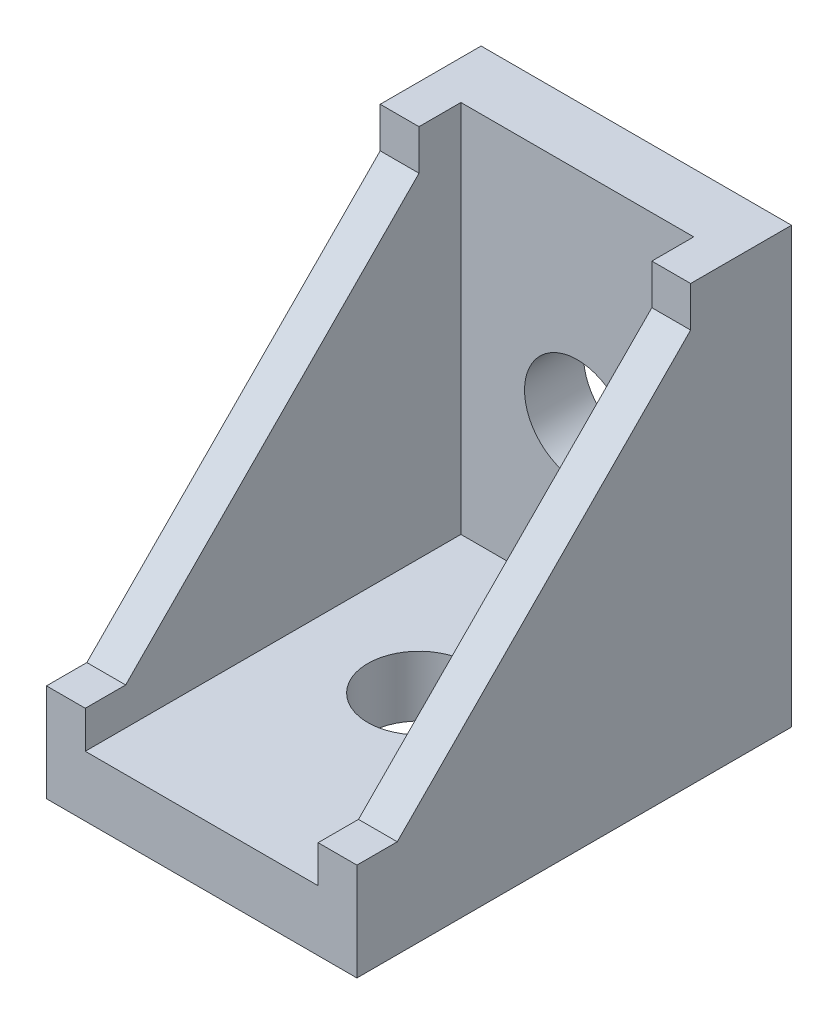
ISO-10303-21;
HEADER;
FILE_DESCRIPTION(('STEP AP214'),'2;1');
FILE_NAME('part.step','',(''),(''),'','','');
FILE_SCHEMA(('AUTOMOTIVE_DESIGN { 1 0 10303 214 1 1 1 1 }'));
ENDSEC;
DATA;
#1=APPLICATION_CONTEXT('core data for automotive mechanical design processes');
#2=APPLICATION_PROTOCOL_DEFINITION('international standard','automotive_design',2000,#1);
#3=PRODUCT_CONTEXT('',#1,'mechanical');
#4=PRODUCT('Part','Part','',(#3));
#5=PRODUCT_RELATED_PRODUCT_CATEGORY('part','',(#4));
#6=PRODUCT_DEFINITION_FORMATION('','',#4);
#7=PRODUCT_DEFINITION_CONTEXT('part definition',#1,'design');
#8=PRODUCT_DEFINITION('design','',#6,#7);
#9=PRODUCT_DEFINITION_SHAPE('','',#8);
#10=(LENGTH_UNIT() NAMED_UNIT(*) SI_UNIT(.MILLI.,.METRE.));
#11=(NAMED_UNIT(*) PLANE_ANGLE_UNIT() SI_UNIT($,.RADIAN.));
#12=(NAMED_UNIT(*) SI_UNIT($,.STERADIAN.) SOLID_ANGLE_UNIT());
#13=UNCERTAINTY_MEASURE_WITH_UNIT(LENGTH_MEASURE(1.E-05),#10,'distance_accuracy_value','');
#14=(GEOMETRIC_REPRESENTATION_CONTEXT(3) GLOBAL_UNCERTAINTY_ASSIGNED_CONTEXT((#13)) GLOBAL_UNIT_ASSIGNED_CONTEXT((#10,
#11,#12)) REPRESENTATION_CONTEXT('',''));
#15=CARTESIAN_POINT('',(0.,0.,0.));
#16=DIRECTION('',(0.,0.,1.));
#17=DIRECTION('',(1.,0.,0.));
#18=AXIS2_PLACEMENT_3D('',#15,#16,#17);
#19=CARTESIAN_POINT('',(7.5,14.,6.5));
#20=DIRECTION('',(0.,0.,-1.));
#21=DIRECTION('',(0.,1.,0.));
#22=AXIS2_PLACEMENT_3D('',#19,#20,#21);
#23=PLANE('',#22);
#24=DIRECTION('',(1.,0.,0.));
#25=VECTOR('',#24,1.);
#26=CARTESIAN_POINT('',(7.5,11.4,6.5));
#27=LINE('',#26,#25);
#28=CARTESIAN_POINT('',(7.5,11.4,6.5));
#29=VERTEX_POINT('',#28);
#30=CARTESIAN_POINT('',(10.,11.4,6.5));
#31=VERTEX_POINT('',#30);
#32=EDGE_CURVE('E53',#29,#31,#27,.T.);
#33=ORIENTED_EDGE('',*,*,#32,.T.);
#34=DIRECTION('',(0.,1.,0.));
#35=VECTOR('',#34,1.);
#36=CARTESIAN_POINT('',(10.,14.,6.5));
#37=LINE('',#36,#35);
#38=CARTESIAN_POINT('',(10.,14.,6.5));
#39=VERTEX_POINT('',#38);
#40=EDGE_CURVE('E164',#31,#39,#37,.T.);
#41=ORIENTED_EDGE('',*,*,#40,.T.);
#42=DIRECTION('',(1.,0.,0.));
#43=VECTOR('',#42,1.);
#44=CARTESIAN_POINT('',(7.5,14.,6.5));
#45=LINE('',#44,#43);
#46=CARTESIAN_POINT('',(7.5,14.,6.5));
#47=VERTEX_POINT('',#46);
#48=EDGE_CURVE('E176',#47,#39,#45,.T.);
#49=ORIENTED_EDGE('',*,*,#48,.F.);
#50=DIRECTION('',(0.,1.,0.));
#51=VECTOR('',#50,1.);
#52=CARTESIAN_POINT('',(7.5,14.,6.5));
#53=LINE('',#52,#51);
#54=EDGE_CURVE('E58',#29,#47,#53,.T.);
#55=ORIENTED_EDGE('',*,*,#54,.F.);
#56=EDGE_LOOP('',(#33,#41,#49,#55));
#57=FACE_BOUND('',#56,.T.);
#58=ADVANCED_FACE('F38',(#57),#23,.F.);
#59=CARTESIAN_POINT('',(7.5,-7.69999999999999,28.));
#60=DIRECTION('',(0.,-1.,0.));
#61=DIRECTION('',(0.,0.,-1.));
#62=AXIS2_PLACEMENT_3D('',#59,#60,#61);
#63=PLANE('',#62);
#64=DIRECTION('',(1.,0.,0.));
#65=VECTOR('',#64,1.);
#66=CARTESIAN_POINT('',(7.5,-7.69999999999999,25.4));
#67=LINE('',#66,#65);
#68=CARTESIAN_POINT('',(7.5,-7.69999999999999,25.4));
#69=VERTEX_POINT('',#68);
#70=CARTESIAN_POINT('',(10.,-7.69999999999999,25.4));
#71=VERTEX_POINT('',#70);
#72=EDGE_CURVE('E288',#69,#71,#67,.T.);
#73=ORIENTED_EDGE('',*,*,#72,.F.);
#74=DIRECTION('',(0.,0.,-1.));
#75=VECTOR('',#74,1.);
#76=CARTESIAN_POINT('',(7.5,-7.69999999999999,28.));
#77=LINE('',#76,#75);
#78=CARTESIAN_POINT('',(7.5,-7.69999999999999,28.));
#79=VERTEX_POINT('',#78);
#80=EDGE_CURVE('E265',#79,#69,#77,.T.);
#81=ORIENTED_EDGE('',*,*,#80,.F.);
#82=DIRECTION('',(1.,0.,0.));
#83=VECTOR('',#82,1.);
#84=CARTESIAN_POINT('',(7.5,-7.69999999999999,28.));
#85=LINE('',#84,#83);
#86=CARTESIAN_POINT('',(10.,-7.69999999999999,28.));
#87=VERTEX_POINT('',#86);
#88=EDGE_CURVE('E170',#79,#87,#85,.T.);
#89=ORIENTED_EDGE('',*,*,#88,.T.);
#90=DIRECTION('',(0.,0.,-1.));
#91=VECTOR('',#90,1.);
#92=CARTESIAN_POINT('',(10.,-7.69999999999999,28.));
#93=LINE('',#92,#91);
#94=EDGE_CURVE('E258',#87,#71,#93,.T.);
#95=ORIENTED_EDGE('',*,*,#94,.T.);
#96=EDGE_LOOP('',(#73,#81,#89,#95));
#97=FACE_BOUND('',#96,.T.);
#98=ADVANCED_FACE('F271',(#97),#63,.F.);
#99=CARTESIAN_POINT('',(0.,-10.1,0.));
#100=DIRECTION('',(0.,-1.,0.));
#101=DIRECTION('',(0.,0.,-1.));
#102=AXIS2_PLACEMENT_3D('',#99,#100,#101);
#103=PLANE('',#102);
#104=CARTESIAN_POINT('',(0.,-10.1,14.));
#105=DIRECTION('',(0.,-1.,0.));
#106=DIRECTION('',(0.,0.,-1.));
#107=AXIS2_PLACEMENT_3D('',#104,#105,#106);
#108=CIRCLE('',#107,3.3);
#109=CARTESIAN_POINT('',(0.,-10.1,10.7));
#110=VERTEX_POINT('',#109);
#111=EDGE_CURVE('E194',#110,#110,#108,.T.);
#112=ORIENTED_EDGE('',*,*,#111,.T.);
#113=EDGE_LOOP('',(#112));
#114=FACE_BOUND('',#113,.T.);
#115=DIRECTION('',(-1.,0.,0.));
#116=VECTOR('',#115,1.);
#117=CARTESIAN_POINT('',(10.,-10.1,28.));
#118=LINE('',#117,#116);
#119=CARTESIAN_POINT('',(7.5,-10.1,28.));
#120=VERTEX_POINT('',#119);
#121=CARTESIAN_POINT('',(-7.5,-10.1,28.));
#122=VERTEX_POINT('',#121);
#123=EDGE_CURVE('E200',#120,#122,#118,.T.);
#124=ORIENTED_EDGE('',*,*,#123,.F.);
#125=DIRECTION('',(0.,0.,1.));
#126=VECTOR('',#125,1.);
#127=CARTESIAN_POINT('',(7.5,-10.1,0.));
#128=LINE('',#127,#126);
#129=CARTESIAN_POINT('',(7.5,-10.1,3.8));
#130=VERTEX_POINT('',#129);
#131=EDGE_CURVE('E11',#130,#120,#128,.T.);
#132=ORIENTED_EDGE('',*,*,#131,.F.);
#133=DIRECTION('',(1.,0.,0.));
#134=VECTOR('',#133,1.);
#135=CARTESIAN_POINT('',(0.,-10.1,3.8));
#136=LINE('',#135,#134);
#137=CARTESIAN_POINT('',(-7.5,-10.1,3.8));
#138=VERTEX_POINT('',#137);
#139=EDGE_CURVE('E207',#138,#130,#136,.T.);
#140=ORIENTED_EDGE('',*,*,#139,.F.);
#141=DIRECTION('',(0.,0.,-1.));
#142=VECTOR('',#141,1.);
#143=CARTESIAN_POINT('',(-7.5,-10.1,0.));
#144=LINE('',#143,#142);
#145=EDGE_CURVE('E46',#122,#138,#144,.T.);
#146=ORIENTED_EDGE('',*,*,#145,.F.);
#147=EDGE_LOOP('',(#124,#132,#140,#146));
#148=FACE_BOUND('',#147,.T.);
#149=ADVANCED_FACE('F246',(#114,#148),#103,.F.);
#150=CARTESIAN_POINT('',(0.,0.,3.8));
#151=DIRECTION('',(0.,0.,1.));
#152=DIRECTION('',(1.,0.,0.));
#153=AXIS2_PLACEMENT_3D('',#150,#151,#152);
#154=PLANE('',#153);
#155=CARTESIAN_POINT('',(0.,0.,3.8));
#156=DIRECTION('',(0.,0.,1.));
#157=DIRECTION('',(1.,0.,0.));
#158=AXIS2_PLACEMENT_3D('',#155,#156,#157);
#159=CIRCLE('',#158,3.4);
#160=CARTESIAN_POINT('',(3.4,0.,3.8));
#161=VERTEX_POINT('',#160);
#162=EDGE_CURVE('E213',#161,#161,#159,.T.);
#163=ORIENTED_EDGE('',*,*,#162,.F.);
#164=EDGE_LOOP('',(#163));
#165=FACE_BOUND('',#164,.T.);
#166=ORIENTED_EDGE('',*,*,#139,.T.);
#167=DIRECTION('',(0.,1.,0.));
#168=VECTOR('',#167,1.);
#169=CARTESIAN_POINT('',(7.5,0.,3.8));
#170=LINE('',#169,#168);
#171=CARTESIAN_POINT('',(7.5,14.,3.8));
#172=VERTEX_POINT('',#171);
#173=EDGE_CURVE('E180',#130,#172,#170,.T.);
#174=ORIENTED_EDGE('',*,*,#173,.T.);
#175=DIRECTION('',(-1.,0.,0.));
#176=VECTOR('',#175,1.);
#177=CARTESIAN_POINT('',(-10.,14.,3.8));
#178=LINE('',#177,#176);
#179=CARTESIAN_POINT('',(-7.5,14.,3.8));
#180=VERTEX_POINT('',#179);
#181=EDGE_CURVE('E219',#172,#180,#178,.T.);
#182=ORIENTED_EDGE('',*,*,#181,.T.);
#183=DIRECTION('',(0.,-1.,0.));
#184=VECTOR('',#183,1.);
#185=CARTESIAN_POINT('',(-7.5,0.,3.8));
#186=LINE('',#185,#184);
#187=EDGE_CURVE('E191',#180,#138,#186,.T.);
#188=ORIENTED_EDGE('',*,*,#187,.T.);
#189=EDGE_LOOP('',(#166,#174,#182,#188));
#190=FACE_BOUND('',#189,.T.);
#191=ADVANCED_FACE('F248',(#165,#190),#154,.T.);
#192=CARTESIAN_POINT('',(0.,0.,0.));
#193=DIRECTION('',(0.,0.,1.));
#194=DIRECTION('',(1.,0.,0.));
#195=AXIS2_PLACEMENT_3D('',#192,#193,#194);
#196=PLANE('',#195);
#197=DIRECTION('',(-1.,0.,0.));
#198=VECTOR('',#197,1.);
#199=CARTESIAN_POINT('',(-10.,14.,0.));
#200=LINE('',#199,#198);
#201=CARTESIAN_POINT('',(10.,14.,0.));
#202=VERTEX_POINT('',#201);
#203=CARTESIAN_POINT('',(-10.,14.,0.));
#204=VERTEX_POINT('',#203);
#205=EDGE_CURVE('E224',#202,#204,#200,.T.);
#206=ORIENTED_EDGE('',*,*,#205,.F.);
#207=DIRECTION('',(0.,1.,0.));
#208=VECTOR('',#207,1.);
#209=CARTESIAN_POINT('',(10.,14.,0.));
#210=LINE('',#209,#208);
#211=CARTESIAN_POINT('',(10.,-14.,0.));
#212=VERTEX_POINT('',#211);
#213=EDGE_CURVE('E216',#212,#202,#210,.T.);
#214=ORIENTED_EDGE('',*,*,#213,.F.);
#215=DIRECTION('',(1.,0.,0.));
#216=VECTOR('',#215,1.);
#217=CARTESIAN_POINT('',(-10.,-14.,0.));
#218=LINE('',#217,#216);
#219=CARTESIAN_POINT('',(-10.,-14.,0.));
#220=VERTEX_POINT('',#219);
#221=EDGE_CURVE('E222',#220,#212,#218,.T.);
#222=ORIENTED_EDGE('',*,*,#221,.F.);
#223=DIRECTION('',(0.,-1.,0.));
#224=VECTOR('',#223,1.);
#225=CARTESIAN_POINT('',(-10.,14.,0.));
#226=LINE('',#225,#224);
#227=EDGE_CURVE('E226',#204,#220,#226,.T.);
#228=ORIENTED_EDGE('',*,*,#227,.F.);
#229=EDGE_LOOP('',(#206,#214,#222,#228));
#230=FACE_BOUND('',#229,.T.);
#231=CARTESIAN_POINT('',(0.,0.,0.));
#232=DIRECTION('',(0.,0.,1.));
#233=DIRECTION('',(1.,0.,0.));
#234=AXIS2_PLACEMENT_3D('',#231,#232,#233);
#235=CIRCLE('',#234,3.4);
#236=CARTESIAN_POINT('',(3.4,0.,0.));
#237=VERTEX_POINT('',#236);
#238=EDGE_CURVE('E212',#237,#237,#235,.T.);
#239=ORIENTED_EDGE('',*,*,#238,.T.);
#240=EDGE_LOOP('',(#239));
#241=FACE_BOUND('',#240,.T.);
#242=ADVANCED_FACE('F302',(#230,#241),#196,.F.);
#243=CARTESIAN_POINT('',(10.,14.,3.8));
#244=DIRECTION('',(-1.,0.,0.));
#245=DIRECTION('',(0.,-1.,0.));
#246=AXIS2_PLACEMENT_3D('',#243,#244,#245);
#247=PLANE('',#246);
#248=ORIENTED_EDGE('',*,*,#40,.F.);
#249=DIRECTION('',(0.,0.710818550760268,-0.703375424574297));
#250=VECTOR('',#249,1.);
#251=CARTESIAN_POINT('',(10.,11.4,6.5));
#252=LINE('',#251,#250);
#253=EDGE_CURVE('E281',#71,#31,#252,.T.);
#254=ORIENTED_EDGE('',*,*,#253,.F.);
#255=ORIENTED_EDGE('',*,*,#94,.F.);
#256=DIRECTION('',(0.,-1.,0.));
#257=VECTOR('',#256,1.);
#258=CARTESIAN_POINT('',(10.,-10.1,28.));
#259=LINE('',#258,#257);
#260=CARTESIAN_POINT('',(10.,-14.,28.));
#261=VERTEX_POINT('',#260);
#262=EDGE_CURVE('E202',#87,#261,#259,.T.);
#263=ORIENTED_EDGE('',*,*,#262,.T.);
#264=DIRECTION('',(0.,0.,-1.));
#265=VECTOR('',#264,1.);
#266=CARTESIAN_POINT('',(10.,-14.,3.8));
#267=LINE('',#266,#265);
#268=EDGE_CURVE('E221',#261,#212,#267,.T.);
#269=ORIENTED_EDGE('',*,*,#268,.T.);
#270=ORIENTED_EDGE('',*,*,#213,.T.);
#271=DIRECTION('',(0.,0.,-1.));
#272=VECTOR('',#271,1.);
#273=CARTESIAN_POINT('',(10.,14.,3.8));
#274=LINE('',#273,#272);
#275=EDGE_CURVE('E237',#39,#202,#274,.T.);
#276=ORIENTED_EDGE('',*,*,#275,.F.);
#277=EDGE_LOOP('',(#248,#254,#255,#263,#269,#270,#276));
#278=FACE_BOUND('',#277,.T.);
#279=ADVANCED_FACE('F40',(#278),#247,.F.);
#280=CARTESIAN_POINT('',(-10.,14.,3.8));
#281=DIRECTION('',(0.,-1.,0.));
#282=DIRECTION('',(0.,0.,-1.));
#283=AXIS2_PLACEMENT_3D('',#280,#281,#282);
#284=PLANE('',#283);
#285=ORIENTED_EDGE('',*,*,#205,.T.);
#286=DIRECTION('',(0.,0.,-1.));
#287=VECTOR('',#286,1.);
#288=CARTESIAN_POINT('',(-10.,14.,3.8));
#289=LINE('',#288,#287);
#290=CARTESIAN_POINT('',(-10.,14.,6.5));
#291=VERTEX_POINT('',#290);
#292=EDGE_CURVE('E234',#291,#204,#289,.T.);
#293=ORIENTED_EDGE('',*,*,#292,.F.);
#294=DIRECTION('',(-1.,0.,0.));
#295=VECTOR('',#294,1.);
#296=CARTESIAN_POINT('',(-7.5,14.,6.5));
#297=LINE('',#296,#295);
#298=CARTESIAN_POINT('',(-7.5,14.,6.5));
#299=VERTEX_POINT('',#298);
#300=EDGE_CURVE('E187',#299,#291,#297,.T.);
#301=ORIENTED_EDGE('',*,*,#300,.F.);
#302=DIRECTION('',(0.,0.,-1.));
#303=VECTOR('',#302,1.);
#304=CARTESIAN_POINT('',(-7.5,14.,0.));
#305=LINE('',#304,#303);
#306=EDGE_CURVE('E184',#299,#180,#305,.T.);
#307=ORIENTED_EDGE('',*,*,#306,.T.);
#308=ORIENTED_EDGE('',*,*,#181,.F.);
#309=DIRECTION('',(0.,0.,-1.));
#310=VECTOR('',#309,1.);
#311=CARTESIAN_POINT('',(7.5,14.,0.));
#312=LINE('',#311,#310);
#313=EDGE_CURVE('E172',#47,#172,#312,.T.);
#314=ORIENTED_EDGE('',*,*,#313,.F.);
#315=ORIENTED_EDGE('',*,*,#48,.T.);
#316=ORIENTED_EDGE('',*,*,#275,.T.);
#317=EDGE_LOOP('',(#285,#293,#301,#307,#308,#314,#315,#316));
#318=FACE_BOUND('',#317,.T.);
#319=ADVANCED_FACE('F252',(#318),#284,.F.);
#320=CARTESIAN_POINT('',(-10.,14.,3.8));
#321=DIRECTION('',(1.,0.,0.));
#322=DIRECTION('',(0.,1.,0.));
#323=AXIS2_PLACEMENT_3D('',#320,#321,#322);
#324=PLANE('',#323);
#325=DIRECTION('',(0.,0.710818550760268,-0.703375424574297));
#326=VECTOR('',#325,1.);
#327=CARTESIAN_POINT('',(-10.,11.4,6.5));
#328=LINE('',#327,#326);
#329=CARTESIAN_POINT('',(-10.,-7.69999999999999,25.4));
#330=VERTEX_POINT('',#329);
#331=CARTESIAN_POINT('',(-10.,11.4,6.5));
#332=VERTEX_POINT('',#331);
#333=EDGE_CURVE('E142',#330,#332,#328,.T.);
#334=ORIENTED_EDGE('',*,*,#333,.T.);
#335=DIRECTION('',(0.,1.,0.));
#336=VECTOR('',#335,1.);
#337=CARTESIAN_POINT('',(-10.,14.,6.5));
#338=LINE('',#337,#336);
#339=EDGE_CURVE('E182',#332,#291,#338,.T.);
#340=ORIENTED_EDGE('',*,*,#339,.T.);
#341=ORIENTED_EDGE('',*,*,#292,.T.);
#342=ORIENTED_EDGE('',*,*,#227,.T.);
#343=DIRECTION('',(0.,0.,-1.));
#344=VECTOR('',#343,1.);
#345=CARTESIAN_POINT('',(-10.,-14.,3.8));
#346=LINE('',#345,#344);
#347=CARTESIAN_POINT('',(-10.,-14.,28.));
#348=VERTEX_POINT('',#347);
#349=EDGE_CURVE('E231',#348,#220,#346,.T.);
#350=ORIENTED_EDGE('',*,*,#349,.F.);
#351=DIRECTION('',(0.,-1.,0.));
#352=VECTOR('',#351,1.);
#353=CARTESIAN_POINT('',(-10.,-10.1,28.));
#354=LINE('',#353,#352);
#355=CARTESIAN_POINT('',(-10.,-7.69999999999999,28.));
#356=VERTEX_POINT('',#355);
#357=EDGE_CURVE('E204',#356,#348,#354,.T.);
#358=ORIENTED_EDGE('',*,*,#357,.F.);
#359=DIRECTION('',(0.,0.,-1.));
#360=VECTOR('',#359,1.);
#361=CARTESIAN_POINT('',(-10.,-7.69999999999999,28.));
#362=LINE('',#361,#360);
#363=EDGE_CURVE('E166',#356,#330,#362,.T.);
#364=ORIENTED_EDGE('',*,*,#363,.T.);
#365=EDGE_LOOP('',(#334,#340,#341,#342,#350,#358,#364));
#366=FACE_BOUND('',#365,.T.);
#367=ADVANCED_FACE('F292',(#366),#324,.F.);
#368=CARTESIAN_POINT('',(-10.,-14.,3.8));
#369=DIRECTION('',(0.,1.,0.));
#370=DIRECTION('',(0.,0.,1.));
#371=AXIS2_PLACEMENT_3D('',#368,#369,#370);
#372=PLANE('',#371);
#373=DIRECTION('',(-1.,0.,0.));
#374=VECTOR('',#373,1.);
#375=CARTESIAN_POINT('',(10.,-14.,28.));
#376=LINE('',#375,#374);
#377=EDGE_CURVE('E197',#261,#348,#376,.T.);
#378=ORIENTED_EDGE('',*,*,#377,.T.);
#379=ORIENTED_EDGE('',*,*,#349,.T.);
#380=ORIENTED_EDGE('',*,*,#221,.T.);
#381=ORIENTED_EDGE('',*,*,#268,.F.);
#382=EDGE_LOOP('',(#378,#379,#380,#381));
#383=FACE_BOUND('',#382,.T.);
#384=CARTESIAN_POINT('',(0.,-14.,14.));
#385=DIRECTION('',(0.,-1.,0.));
#386=DIRECTION('',(0.,0.,-1.));
#387=AXIS2_PLACEMENT_3D('',#384,#385,#386);
#388=CIRCLE('',#387,3.3);
#389=CARTESIAN_POINT('',(0.,-14.,10.7));
#390=VERTEX_POINT('',#389);
#391=EDGE_CURVE('E193',#390,#390,#388,.T.);
#392=ORIENTED_EDGE('',*,*,#391,.F.);
#393=EDGE_LOOP('',(#392));
#394=FACE_BOUND('',#393,.T.);
#395=ADVANCED_FACE('F297',(#383,#394),#372,.F.);
#396=CARTESIAN_POINT('',(0.,0.,3.8));
#397=DIRECTION('',(0.,0.,-1.));
#398=DIRECTION('',(-1.,0.,0.));
#399=AXIS2_PLACEMENT_3D('',#396,#397,#398);
#400=CYLINDRICAL_SURFACE('',#399,3.4);
#401=ORIENTED_EDGE('',*,*,#162,.T.);
#402=EDGE_LOOP('',(#401));
#403=FACE_BOUND('',#402,.T.);
#404=ORIENTED_EDGE('',*,*,#238,.F.);
#405=EDGE_LOOP('',(#404));
#406=FACE_BOUND('',#405,.T.);
#407=ADVANCED_FACE('F327',(#403,#406),#400,.F.);
#408=CARTESIAN_POINT('',(10.,-10.1,28.));
#409=DIRECTION('',(0.,0.,1.));
#410=DIRECTION('',(1.,0.,0.));
#411=AXIS2_PLACEMENT_3D('',#408,#409,#410);
#412=PLANE('',#411);
#413=ORIENTED_EDGE('',*,*,#262,.F.);
#414=ORIENTED_EDGE('',*,*,#88,.F.);
#415=DIRECTION('',(0.,1.,0.));
#416=VECTOR('',#415,1.);
#417=CARTESIAN_POINT('',(7.5,-14.,28.));
#418=LINE('',#417,#416);
#419=EDGE_CURVE('E260',#120,#79,#418,.T.);
#420=ORIENTED_EDGE('',*,*,#419,.F.);
#421=ORIENTED_EDGE('',*,*,#123,.T.);
#422=DIRECTION('',(0.,1.,0.));
#423=VECTOR('',#422,1.);
#424=CARTESIAN_POINT('',(-7.5,-14.,28.));
#425=LINE('',#424,#423);
#426=CARTESIAN_POINT('',(-7.5,-7.69999999999999,28.));
#427=VERTEX_POINT('',#426);
#428=EDGE_CURVE('E162',#122,#427,#425,.T.);
#429=ORIENTED_EDGE('',*,*,#428,.T.);
#430=DIRECTION('',(-1.,0.,0.));
#431=VECTOR('',#430,1.);
#432=CARTESIAN_POINT('',(-7.5,-7.69999999999999,28.));
#433=LINE('',#432,#431);
#434=EDGE_CURVE('E161',#427,#356,#433,.T.);
#435=ORIENTED_EDGE('',*,*,#434,.T.);
#436=ORIENTED_EDGE('',*,*,#357,.T.);
#437=ORIENTED_EDGE('',*,*,#377,.F.);
#438=EDGE_LOOP('',(#413,#414,#420,#421,#429,#435,#436,#437));
#439=FACE_BOUND('',#438,.T.);
#440=ADVANCED_FACE('F276',(#439),#412,.T.);
#441=CARTESIAN_POINT('',(0.,-10.1,14.));
#442=DIRECTION('',(0.,-1.,0.));
#443=DIRECTION('',(0.,0.,-1.));
#444=AXIS2_PLACEMENT_3D('',#441,#442,#443);
#445=CYLINDRICAL_SURFACE('',#444,3.3);
#446=ORIENTED_EDGE('',*,*,#111,.F.);
#447=EDGE_LOOP('',(#446));
#448=FACE_BOUND('',#447,.T.);
#449=ORIENTED_EDGE('',*,*,#391,.T.);
#450=EDGE_LOOP('',(#449));
#451=FACE_BOUND('',#450,.T.);
#452=ADVANCED_FACE('F318',(#448,#451),#445,.F.);
#453=CARTESIAN_POINT('',(-7.5,14.,6.5));
#454=DIRECTION('',(0.,0.,1.));
#455=DIRECTION('',(0.,-1.,0.));
#456=AXIS2_PLACEMENT_3D('',#453,#454,#455);
#457=PLANE('',#456);
#458=DIRECTION('',(-1.,0.,0.));
#459=VECTOR('',#458,1.);
#460=CARTESIAN_POINT('',(-7.5,11.4,6.5));
#461=LINE('',#460,#459);
#462=CARTESIAN_POINT('',(-7.5,11.4,6.5));
#463=VERTEX_POINT('',#462);
#464=EDGE_CURVE('E147',#463,#332,#461,.T.);
#465=ORIENTED_EDGE('',*,*,#464,.F.);
#466=DIRECTION('',(0.,1.,0.));
#467=VECTOR('',#466,1.);
#468=CARTESIAN_POINT('',(-7.5,14.,6.5));
#469=LINE('',#468,#467);
#470=EDGE_CURVE('E156',#463,#299,#469,.T.);
#471=ORIENTED_EDGE('',*,*,#470,.T.);
#472=ORIENTED_EDGE('',*,*,#300,.T.);
#473=ORIENTED_EDGE('',*,*,#339,.F.);
#474=EDGE_LOOP('',(#465,#471,#472,#473));
#475=FACE_BOUND('',#474,.T.);
#476=ADVANCED_FACE('F257',(#475),#457,.T.);
#477=CARTESIAN_POINT('',(-7.5,0.,0.));
#478=DIRECTION('',(-1.,0.,0.));
#479=DIRECTION('',(0.,-1.,0.));
#480=AXIS2_PLACEMENT_3D('',#477,#478,#479);
#481=PLANE('',#480);
#482=ORIENTED_EDGE('',*,*,#470,.F.);
#483=DIRECTION('',(0.,0.710818550760268,-0.703375424574297));
#484=VECTOR('',#483,1.);
#485=CARTESIAN_POINT('',(-7.5,11.4,6.5));
#486=LINE('',#485,#484);
#487=CARTESIAN_POINT('',(-7.5,-7.69999999999999,25.4));
#488=VERTEX_POINT('',#487);
#489=EDGE_CURVE('E139',#488,#463,#486,.T.);
#490=ORIENTED_EDGE('',*,*,#489,.F.);
#491=DIRECTION('',(0.,0.,-1.));
#492=VECTOR('',#491,1.);
#493=CARTESIAN_POINT('',(-7.5,-7.69999999999999,28.));
#494=LINE('',#493,#492);
#495=EDGE_CURVE('E154',#427,#488,#494,.T.);
#496=ORIENTED_EDGE('',*,*,#495,.F.);
#497=ORIENTED_EDGE('',*,*,#428,.F.);
#498=ORIENTED_EDGE('',*,*,#145,.T.);
#499=ORIENTED_EDGE('',*,*,#187,.F.);
#500=ORIENTED_EDGE('',*,*,#306,.F.);
#501=EDGE_LOOP('',(#482,#490,#496,#497,#498,#499,#500));
#502=FACE_BOUND('',#501,.T.);
#503=ADVANCED_FACE('F152',(#502),#481,.F.);
#504=CARTESIAN_POINT('',(7.5,0.,0.));
#505=DIRECTION('',(1.,0.,0.));
#506=DIRECTION('',(0.,-1.,0.));
#507=AXIS2_PLACEMENT_3D('',#504,#505,#506);
#508=PLANE('',#507);
#509=DIRECTION('',(0.,0.710818550760268,-0.703375424574297));
#510=VECTOR('',#509,1.);
#511=CARTESIAN_POINT('',(7.5,11.4,6.5));
#512=LINE('',#511,#510);
#513=EDGE_CURVE('E284',#69,#29,#512,.T.);
#514=ORIENTED_EDGE('',*,*,#513,.T.);
#515=ORIENTED_EDGE('',*,*,#54,.T.);
#516=ORIENTED_EDGE('',*,*,#313,.T.);
#517=ORIENTED_EDGE('',*,*,#173,.F.);
#518=ORIENTED_EDGE('',*,*,#131,.T.);
#519=ORIENTED_EDGE('',*,*,#419,.T.);
#520=ORIENTED_EDGE('',*,*,#80,.T.);
#521=EDGE_LOOP('',(#514,#515,#516,#517,#518,#519,#520));
#522=FACE_BOUND('',#521,.T.);
#523=ADVANCED_FACE('F312',(#522),#508,.F.);
#524=CARTESIAN_POINT('',(-7.5,-7.69999999999999,28.));
#525=DIRECTION('',(0.,1.,0.));
#526=DIRECTION('',(0.,0.,1.));
#527=AXIS2_PLACEMENT_3D('',#524,#525,#526);
#528=PLANE('',#527);
#529=DIRECTION('',(-1.,0.,0.));
#530=VECTOR('',#529,1.);
#531=CARTESIAN_POINT('',(-7.5,-7.69999999999999,25.4));
#532=LINE('',#531,#530);
#533=EDGE_CURVE('E136',#488,#330,#532,.T.);
#534=ORIENTED_EDGE('',*,*,#533,.T.);
#535=ORIENTED_EDGE('',*,*,#363,.F.);
#536=ORIENTED_EDGE('',*,*,#434,.F.);
#537=ORIENTED_EDGE('',*,*,#495,.T.);
#538=EDGE_LOOP('',(#534,#535,#536,#537));
#539=FACE_BOUND('',#538,.T.);
#540=ADVANCED_FACE('F159',(#539),#528,.T.);
#541=CARTESIAN_POINT('',(-7.5,11.4,6.5));
#542=DIRECTION('',(0.,0.703375424574297,0.710818550760268));
#543=DIRECTION('',(0.,-0.710818550760268,0.703375424574297));
#544=AXIS2_PLACEMENT_3D('',#541,#542,#543);
#545=PLANE('',#544);
#546=ORIENTED_EDGE('',*,*,#333,.F.);
#547=ORIENTED_EDGE('',*,*,#533,.F.);
#548=ORIENTED_EDGE('',*,*,#489,.T.);
#549=ORIENTED_EDGE('',*,*,#464,.T.);
#550=EDGE_LOOP('',(#546,#547,#548,#549));
#551=FACE_BOUND('',#550,.T.);
#552=ADVANCED_FACE('F138',(#551),#545,.T.);
#553=CARTESIAN_POINT('',(7.5,11.4,6.5));
#554=DIRECTION('',(0.,-0.703375424574297,-0.710818550760268));
#555=DIRECTION('',(0.,0.710818550760268,-0.703375424574297));
#556=AXIS2_PLACEMENT_3D('',#553,#554,#555);
#557=PLANE('',#556);
#558=ORIENTED_EDGE('',*,*,#253,.T.);
#559=ORIENTED_EDGE('',*,*,#32,.F.);
#560=ORIENTED_EDGE('',*,*,#513,.F.);
#561=ORIENTED_EDGE('',*,*,#72,.T.);
#562=EDGE_LOOP('',(#558,#559,#560,#561));
#563=FACE_BOUND('',#562,.T.);
#564=ADVANCED_FACE('F376',(#563),#557,.F.);
#565=CLOSED_SHELL('',(#58,#98,#149,#191,#242,#279,#319,#367,#395,#407,#440,#452,#476,#503,#523,
#540,#552,#564));
#566=MANIFOLD_SOLID_BREP('B2',#565);
#567=ADVANCED_BREP_SHAPE_REPRESENTATION('',(#18,#566),#14);
#568=SHAPE_DEFINITION_REPRESENTATION(#9,#567);
ENDSEC;
END-ISO-10303-21;
